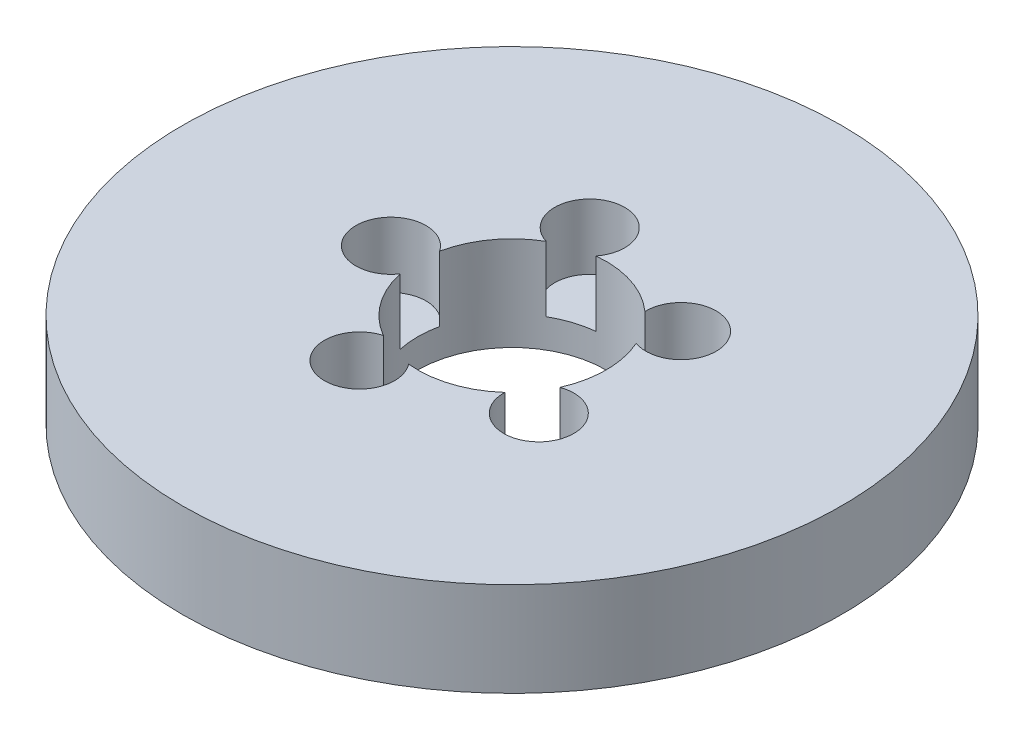
ISO-10303-21;
HEADER;
FILE_DESCRIPTION(('STEP AP214'),'2;1');
FILE_NAME('part.step','',(''),(''),'','','');
FILE_SCHEMA(('AUTOMOTIVE_DESIGN { 1 0 10303 214 1 1 1 1 }'));
ENDSEC;
DATA;
#1=APPLICATION_CONTEXT('core data for automotive mechanical design processes');
#2=APPLICATION_PROTOCOL_DEFINITION('international standard','automotive_design',2000,#1);
#3=PRODUCT_CONTEXT('',#1,'mechanical');
#4=PRODUCT('Part','Part','',(#3));
#5=PRODUCT_RELATED_PRODUCT_CATEGORY('part','',(#4));
#6=PRODUCT_DEFINITION_FORMATION('','',#4);
#7=PRODUCT_DEFINITION_CONTEXT('part definition',#1,'design');
#8=PRODUCT_DEFINITION('design','',#6,#7);
#9=PRODUCT_DEFINITION_SHAPE('','',#8);
#10=(LENGTH_UNIT() NAMED_UNIT(*) SI_UNIT(.MILLI.,.METRE.));
#11=(NAMED_UNIT(*) PLANE_ANGLE_UNIT() SI_UNIT($,.RADIAN.));
#12=(NAMED_UNIT(*) SI_UNIT($,.STERADIAN.) SOLID_ANGLE_UNIT());
#13=UNCERTAINTY_MEASURE_WITH_UNIT(LENGTH_MEASURE(1.E-05),#10,'distance_accuracy_value','');
#14=(GEOMETRIC_REPRESENTATION_CONTEXT(3) GLOBAL_UNCERTAINTY_ASSIGNED_CONTEXT((#13)) GLOBAL_UNIT_ASSIGNED_CONTEXT((#10,
#11,#12)) REPRESENTATION_CONTEXT('',''));
#15=CARTESIAN_POINT('',(0.,0.,0.));
#16=DIRECTION('',(0.,0.,1.));
#17=DIRECTION('',(1.,0.,0.));
#18=AXIS2_PLACEMENT_3D('',#15,#16,#17);
#19=CARTESIAN_POINT('',(0.,10.,0.));
#20=DIRECTION('',(0.,-1.,0.));
#21=DIRECTION('',(0.,0.,-1.));
#22=AXIS2_PLACEMENT_3D('',#19,#20,#21);
#23=CYLINDRICAL_SURFACE('',#22,35.);
#24=CARTESIAN_POINT('',(0.,10.,0.));
#25=DIRECTION('',(0.,1.,0.));
#26=DIRECTION('',(0.,0.,1.));
#27=AXIS2_PLACEMENT_3D('',#24,#25,#26);
#28=CIRCLE('',#27,35.);
#29=CARTESIAN_POINT('',(0.,10.,35.));
#30=VERTEX_POINT('',#29);
#31=EDGE_CURVE('E157',#30,#30,#28,.T.);
#32=ORIENTED_EDGE('',*,*,#31,.F.);
#33=EDGE_LOOP('',(#32));
#34=FACE_BOUND('',#33,.T.);
#35=CARTESIAN_POINT('',(0.,0.,0.));
#36=DIRECTION('',(0.,1.,0.));
#37=DIRECTION('',(0.,0.,1.));
#38=AXIS2_PLACEMENT_3D('',#35,#36,#37);
#39=CIRCLE('',#38,35.);
#40=CARTESIAN_POINT('',(0.,0.,35.));
#41=VERTEX_POINT('',#40);
#42=EDGE_CURVE('E150',#41,#41,#39,.T.);
#43=ORIENTED_EDGE('',*,*,#42,.T.);
#44=EDGE_LOOP('',(#43));
#45=FACE_BOUND('',#44,.T.);
#46=ADVANCED_FACE('F39',(#34,#45),#23,.T.);
#47=CARTESIAN_POINT('',(0.,10.,0.));
#48=DIRECTION('',(0.,1.,0.));
#49=DIRECTION('',(0.,0.,1.));
#50=AXIS2_PLACEMENT_3D('',#47,#48,#49);
#51=PLANE('',#50);
#52=CARTESIAN_POINT('',(-3.97246074891864,10.,-12.2259770490213));
#53=DIRECTION('',(0.,1.,0.));
#54=DIRECTION('',(-0.95105651629515,0.,0.309016994374958));
#55=AXIS2_PLACEMENT_3D('',#52,#53,#54);
#56=CIRCLE('',#55,3.72304344095065);
#57=CARTESIAN_POINT('',(-1.02845036730045,10.,-9.94697390375583));
#58=VERTEX_POINT('',#57);
#59=CARTESIAN_POINT('',(-5.01465074054874,10.,-8.65177888935645));
#60=VERTEX_POINT('',#59);
#61=EDGE_CURVE('E194',#58,#60,#56,.T.);
#62=ORIENTED_EDGE('',*,*,#61,.F.);
#63=CARTESIAN_POINT('',(0.,10.,0.));
#64=DIRECTION('',(0.,1.,0.));
#65=DIRECTION('',(0.,0.,1.));
#66=AXIS2_PLACEMENT_3D('',#63,#64,#65);
#67=CIRCLE('',#66,10.);
#68=CARTESIAN_POINT('',(6.67871839058284,10.,-7.44276297212874));
#69=VERTEX_POINT('',#68);
#70=EDGE_CURVE('E147',#69,#58,#67,.T.);
#71=ORIENTED_EDGE('',*,*,#70,.F.);
#72=CARTESIAN_POINT('',(10.4000372596434,10.,-7.55606936197143));
#73=DIRECTION('',(0.,1.,0.));
#74=DIRECTION('',(-0.58778525229248,0.,-0.809016994374942));
#75=AXIS2_PLACEMENT_3D('',#72,#73,#74);
#76=CIRCLE('',#75,3.72304344095065);
#77=CARTESIAN_POINT('',(9.14232570721784,10.,-4.05189840237188));
#78=VERTEX_POINT('',#77);
#79=EDGE_CURVE('E254',#78,#69,#76,.T.);
#80=ORIENTED_EDGE('',*,*,#79,.F.);
#81=CARTESIAN_POINT('',(9.1423257072179,10.,4.05189840237175));
#82=VERTEX_POINT('',#81);
#83=EDGE_CURVE('E144',#82,#78,#67,.T.);
#84=ORIENTED_EDGE('',*,*,#83,.F.);
#85=CARTESIAN_POINT('',(10.4000372596435,10.,7.55606936197128));
#86=DIRECTION('',(0.,1.,0.));
#87=DIRECTION('',(0.587785252292469,0.,-0.809016994374951));
#88=AXIS2_PLACEMENT_3D('',#85,#86,#87);
#89=CIRCLE('',#88,3.72304344095065);
#90=CARTESIAN_POINT('',(6.67871839058295,10.,7.44276297212864));
#91=VERTEX_POINT('',#90);
#92=EDGE_CURVE('E141',#91,#82,#89,.T.);
#93=ORIENTED_EDGE('',*,*,#92,.F.);
#94=CARTESIAN_POINT('',(-1.02845036730031,10.,9.94697390375585));
#95=VERTEX_POINT('',#94);
#96=EDGE_CURVE('E134',#95,#91,#67,.T.);
#97=ORIENTED_EDGE('',*,*,#96,.F.);
#98=CARTESIAN_POINT('',(-3.97246074891847,10.,12.2259770490214));
#99=DIRECTION('',(0.,1.,0.));
#100=DIRECTION('',(0.951056516295155,0.,0.309016994374945));
#101=AXIS2_PLACEMENT_3D('',#98,#99,#100);
#102=CIRCLE('',#101,3.72304344095065);
#103=CARTESIAN_POINT('',(-5.01465074054862,10.,8.65177888935652));
#104=VERTEX_POINT('',#103);
#105=EDGE_CURVE('E111',#104,#95,#102,.T.);
#106=ORIENTED_EDGE('',*,*,#105,.F.);
#107=CARTESIAN_POINT('',(-9.7779429899518,10.,2.09566955535754));
#108=VERTEX_POINT('',#107);
#109=EDGE_CURVE('E145',#108,#104,#67,.T.);
#110=ORIENTED_EDGE('',*,*,#109,.F.);
#111=CARTESIAN_POINT('',(-12.85515302145,10.,0.));
#112=DIRECTION('',(0.,1.,0.));
#113=DIRECTION('',(0.,0.,1.));
#114=AXIS2_PLACEMENT_3D('',#111,#112,#113);
#115=CIRCLE('',#114,3.72304344095065);
#116=CARTESIAN_POINT('',(-9.7779429899518,10.,-2.09566955535754));
#117=VERTEX_POINT('',#116);
#118=EDGE_CURVE('E153',#117,#108,#115,.T.);
#119=ORIENTED_EDGE('',*,*,#118,.F.);
#120=EDGE_CURVE('E146',#60,#117,#67,.T.);
#121=ORIENTED_EDGE('',*,*,#120,.F.);
#122=EDGE_LOOP('',(#62,#71,#80,#84,#93,#97,#106,#110,#119,#121));
#123=FACE_BOUND('',#122,.T.);
#124=ORIENTED_EDGE('',*,*,#31,.T.);
#125=EDGE_LOOP('',(#124));
#126=FACE_BOUND('',#125,.T.);
#127=ADVANCED_FACE('F139',(#123,#126),#51,.T.);
#128=CARTESIAN_POINT('',(0.,0.,0.));
#129=DIRECTION('',(0.,1.,0.));
#130=DIRECTION('',(0.,0.,1.));
#131=AXIS2_PLACEMENT_3D('',#128,#129,#130);
#132=PLANE('',#131);
#133=CARTESIAN_POINT('',(0.,0.,0.));
#134=DIRECTION('',(0.,1.,0.));
#135=DIRECTION('',(0.,0.,1.));
#136=AXIS2_PLACEMENT_3D('',#133,#134,#135);
#137=CIRCLE('',#136,10.);
#138=CARTESIAN_POINT('',(0.,0.,10.));
#139=VERTEX_POINT('',#138);
#140=EDGE_CURVE('E154',#139,#139,#137,.T.);
#141=ORIENTED_EDGE('',*,*,#140,.T.);
#142=EDGE_LOOP('',(#141));
#143=FACE_BOUND('',#142,.T.);
#144=ORIENTED_EDGE('',*,*,#42,.F.);
#145=EDGE_LOOP('',(#144));
#146=FACE_BOUND('',#145,.T.);
#147=ADVANCED_FACE('F213',(#143,#146),#132,.F.);
#148=CARTESIAN_POINT('',(0.,10.,0.));
#149=DIRECTION('',(0.,-1.,0.));
#150=DIRECTION('',(0.,0.,-1.));
#151=AXIS2_PLACEMENT_3D('',#148,#149,#150);
#152=CYLINDRICAL_SURFACE('',#151,10.);
#153=DIRECTION('',(0.,1.,0.));
#154=VECTOR('',#153,1.);
#155=CARTESIAN_POINT('',(-1.02845036730045,6.53355313447138,-9.94697390375584));
#156=LINE('',#155,#154);
#157=CARTESIAN_POINT('',(-1.02845036730045,3.06710626894277,-9.94697390375583));
#158=VERTEX_POINT('',#157);
#159=EDGE_CURVE('E11',#158,#58,#156,.T.);
#160=ORIENTED_EDGE('',*,*,#159,.F.);
#161=CARTESIAN_POINT('',(0.,3.06710626894277,0.));
#162=DIRECTION('',(0.,1.,0.));
#163=DIRECTION('',(0.,0.,1.));
#164=AXIS2_PLACEMENT_3D('',#161,#162,#163);
#165=CIRCLE('',#164,10.);
#166=CARTESIAN_POINT('',(-5.01465074054874,3.06710626894277,-8.65177888935645));
#167=VERTEX_POINT('',#166);
#168=EDGE_CURVE('E189',#158,#167,#165,.T.);
#169=ORIENTED_EDGE('',*,*,#168,.T.);
#170=DIRECTION('',(0.,1.,0.));
#171=VECTOR('',#170,1.);
#172=CARTESIAN_POINT('',(-5.01465074054875,6.53355313447138,-8.65177888935645));
#173=LINE('',#172,#171);
#174=EDGE_CURVE('E46',#60,#167,#173,.F.);
#175=ORIENTED_EDGE('',*,*,#174,.F.);
#176=ORIENTED_EDGE('',*,*,#120,.T.);
#177=DIRECTION('',(0.,1.,0.));
#178=VECTOR('',#177,1.);
#179=CARTESIAN_POINT('',(-9.7779429899518,6.53355313447138,-2.09566955535754));
#180=LINE('',#179,#178);
#181=CARTESIAN_POINT('',(-9.7779429899518,3.06710626894277,-2.09566955535754));
#182=VERTEX_POINT('',#181);
#183=EDGE_CURVE('E168',#182,#117,#180,.T.);
#184=ORIENTED_EDGE('',*,*,#183,.F.);
#185=CARTESIAN_POINT('',(0.,3.06710626894277,0.));
#186=DIRECTION('',(0.,1.,0.));
#187=DIRECTION('',(0.,0.,1.));
#188=AXIS2_PLACEMENT_3D('',#185,#186,#187);
#189=CIRCLE('',#188,10.);
#190=CARTESIAN_POINT('',(-9.7779429899518,3.06710626894277,2.09566955535754));
#191=VERTEX_POINT('',#190);
#192=EDGE_CURVE('E165',#182,#191,#189,.T.);
#193=ORIENTED_EDGE('',*,*,#192,.T.);
#194=DIRECTION('',(0.,1.,0.));
#195=VECTOR('',#194,1.);
#196=CARTESIAN_POINT('',(-9.7779429899518,6.53355313447138,2.09566955535754));
#197=LINE('',#196,#195);
#198=EDGE_CURVE('E170',#108,#191,#197,.F.);
#199=ORIENTED_EDGE('',*,*,#198,.F.);
#200=ORIENTED_EDGE('',*,*,#109,.T.);
#201=DIRECTION('',(0.,1.,0.));
#202=VECTOR('',#201,1.);
#203=CARTESIAN_POINT('',(-5.01465074054862,6.53355313447138,8.65177888935652));
#204=LINE('',#203,#202);
#205=CARTESIAN_POINT('',(-5.01465074054862,3.06710626894277,8.65177888935652));
#206=VERTEX_POINT('',#205);
#207=EDGE_CURVE('E121',#206,#104,#204,.T.);
#208=ORIENTED_EDGE('',*,*,#207,.F.);
#209=CARTESIAN_POINT('',(0.,3.06710626894277,0.));
#210=DIRECTION('',(0.,1.,0.));
#211=DIRECTION('',(0.,0.,1.));
#212=AXIS2_PLACEMENT_3D('',#209,#210,#211);
#213=CIRCLE('',#212,10.);
#214=CARTESIAN_POINT('',(-1.02845036730031,3.06710626894277,9.94697390375585));
#215=VERTEX_POINT('',#214);
#216=EDGE_CURVE('E136',#206,#215,#213,.T.);
#217=ORIENTED_EDGE('',*,*,#216,.T.);
#218=DIRECTION('',(0.,1.,0.));
#219=VECTOR('',#218,1.);
#220=CARTESIAN_POINT('',(-1.02845036730031,6.53355313447138,9.94697390375585));
#221=LINE('',#220,#219);
#222=EDGE_CURVE('E117',#95,#215,#221,.F.);
#223=ORIENTED_EDGE('',*,*,#222,.F.);
#224=ORIENTED_EDGE('',*,*,#96,.T.);
#225=DIRECTION('',(0.,1.,0.));
#226=VECTOR('',#225,1.);
#227=CARTESIAN_POINT('',(6.67871839058295,6.53355313447138,7.44276297212864));
#228=LINE('',#227,#226);
#229=CARTESIAN_POINT('',(6.67871839058295,3.06710626894277,7.44276297212864));
#230=VERTEX_POINT('',#229);
#231=EDGE_CURVE('E182',#230,#91,#228,.T.);
#232=ORIENTED_EDGE('',*,*,#231,.F.);
#233=CARTESIAN_POINT('',(0.,3.06710626894277,0.));
#234=DIRECTION('',(0.,1.,0.));
#235=DIRECTION('',(0.,0.,1.));
#236=AXIS2_PLACEMENT_3D('',#233,#234,#235);
#237=CIRCLE('',#236,10.);
#238=CARTESIAN_POINT('',(9.1423257072179,3.06710626894277,4.05189840237175));
#239=VERTEX_POINT('',#238);
#240=EDGE_CURVE('E174',#230,#239,#237,.T.);
#241=ORIENTED_EDGE('',*,*,#240,.T.);
#242=DIRECTION('',(0.,1.,0.));
#243=VECTOR('',#242,1.);
#244=CARTESIAN_POINT('',(9.1423257072179,6.53355313447138,4.05189840237175));
#245=LINE('',#244,#243);
#246=EDGE_CURVE('E177',#82,#239,#245,.F.);
#247=ORIENTED_EDGE('',*,*,#246,.F.);
#248=ORIENTED_EDGE('',*,*,#83,.T.);
#249=DIRECTION('',(0.,1.,0.));
#250=VECTOR('',#249,1.);
#251=CARTESIAN_POINT('',(9.14232570721785,6.53355313447138,-4.05189840237188));
#252=LINE('',#251,#250);
#253=CARTESIAN_POINT('',(9.14232570721784,3.06710626894277,-4.05189840237188));
#254=VERTEX_POINT('',#253);
#255=EDGE_CURVE('E187',#254,#78,#252,.T.);
#256=ORIENTED_EDGE('',*,*,#255,.F.);
#257=CARTESIAN_POINT('',(0.,3.06710626894277,0.));
#258=DIRECTION('',(0.,1.,0.));
#259=DIRECTION('',(0.,0.,1.));
#260=AXIS2_PLACEMENT_3D('',#257,#258,#259);
#261=CIRCLE('',#260,10.);
#262=CARTESIAN_POINT('',(6.67871839058284,3.06710626894277,-7.44276297212874));
#263=VERTEX_POINT('',#262);
#264=EDGE_CURVE('E181',#254,#263,#261,.T.);
#265=ORIENTED_EDGE('',*,*,#264,.T.);
#266=DIRECTION('',(0.,1.,0.));
#267=VECTOR('',#266,1.);
#268=CARTESIAN_POINT('',(6.67871839058284,6.53355313447138,-7.44276297212874));
#269=LINE('',#268,#267);
#270=EDGE_CURVE('E186',#69,#263,#269,.F.);
#271=ORIENTED_EDGE('',*,*,#270,.F.);
#272=ORIENTED_EDGE('',*,*,#70,.T.);
#273=EDGE_LOOP('',(#160,#169,#175,#176,#184,#193,#199,#200,#208,#217,#223,#224,#232,#241,#247,
#248,#256,#265,#271,#272));
#274=FACE_BOUND('',#273,.T.);
#275=ORIENTED_EDGE('',*,*,#140,.F.);
#276=EDGE_LOOP('',(#275));
#277=FACE_BOUND('',#276,.T.);
#278=ADVANCED_FACE('F135',(#274,#277),#152,.F.);
#279=CARTESIAN_POINT('',(-12.85515302145,3.06710626894277,0.));
#280=DIRECTION('',(0.,1.,0.));
#281=DIRECTION('',(0.,0.,1.));
#282=AXIS2_PLACEMENT_3D('',#279,#280,#281);
#283=CYLINDRICAL_SURFACE('',#282,3.72304344095065);
#284=ORIENTED_EDGE('',*,*,#183,.T.);
#285=ORIENTED_EDGE('',*,*,#118,.T.);
#286=ORIENTED_EDGE('',*,*,#198,.T.);
#287=CARTESIAN_POINT('',(-12.85515302145,3.06710626894277,0.));
#288=DIRECTION('',(0.,1.,0.));
#289=DIRECTION('',(0.,0.,1.));
#290=AXIS2_PLACEMENT_3D('',#287,#288,#289);
#291=CIRCLE('',#290,3.72304344095065);
#292=EDGE_CURVE('E158',#182,#191,#291,.T.);
#293=ORIENTED_EDGE('',*,*,#292,.F.);
#294=EDGE_LOOP('',(#284,#285,#286,#293));
#295=FACE_BOUND('',#294,.T.);
#296=ADVANCED_FACE('F221',(#295),#283,.F.);
#297=CARTESIAN_POINT('',(-12.85515302145,3.06710626894277,0.));
#298=DIRECTION('',(0.,1.,0.));
#299=DIRECTION('',(0.,0.,1.));
#300=AXIS2_PLACEMENT_3D('',#297,#298,#299);
#301=PLANE('',#300);
#302=ORIENTED_EDGE('',*,*,#292,.T.);
#303=ORIENTED_EDGE('',*,*,#192,.F.);
#304=EDGE_LOOP('',(#302,#303));
#305=FACE_BOUND('',#304,.T.);
#306=ADVANCED_FACE('F227',(#305),#301,.T.);
#307=CARTESIAN_POINT('',(-3.97246074891847,3.06710626894277,12.2259770490214));
#308=DIRECTION('',(0.,1.,0.));
#309=DIRECTION('',(0.,0.,1.));
#310=AXIS2_PLACEMENT_3D('',#307,#308,#309);
#311=CYLINDRICAL_SURFACE('',#310,3.72304344095065);
#312=ORIENTED_EDGE('',*,*,#207,.T.);
#313=ORIENTED_EDGE('',*,*,#105,.T.);
#314=ORIENTED_EDGE('',*,*,#222,.T.);
#315=CARTESIAN_POINT('',(-3.97246074891847,3.06710626894277,12.2259770490214));
#316=DIRECTION('',(0.,1.,0.));
#317=DIRECTION('',(0.951056516295155,0.,0.309016994374945));
#318=AXIS2_PLACEMENT_3D('',#315,#316,#317);
#319=CIRCLE('',#318,3.72304344095065);
#320=EDGE_CURVE('E127',#206,#215,#319,.T.);
#321=ORIENTED_EDGE('',*,*,#320,.F.);
#322=EDGE_LOOP('',(#312,#313,#314,#321));
#323=FACE_BOUND('',#322,.T.);
#324=ADVANCED_FACE('F116',(#323),#311,.F.);
#325=CARTESIAN_POINT('',(-3.97246074891847,3.06710626894277,12.2259770490214));
#326=DIRECTION('',(0.,1.,0.));
#327=DIRECTION('',(0.951056516295155,0.,0.309016994374945));
#328=AXIS2_PLACEMENT_3D('',#325,#326,#327);
#329=PLANE('',#328);
#330=ORIENTED_EDGE('',*,*,#320,.T.);
#331=ORIENTED_EDGE('',*,*,#216,.F.);
#332=EDGE_LOOP('',(#330,#331));
#333=FACE_BOUND('',#332,.T.);
#334=ADVANCED_FACE('F234',(#333),#329,.T.);
#335=CARTESIAN_POINT('',(10.4000372596435,3.06710626894277,7.55606936197128));
#336=DIRECTION('',(0.,1.,0.));
#337=DIRECTION('',(0.,0.,1.));
#338=AXIS2_PLACEMENT_3D('',#335,#336,#337);
#339=CYLINDRICAL_SURFACE('',#338,3.72304344095065);
#340=ORIENTED_EDGE('',*,*,#231,.T.);
#341=ORIENTED_EDGE('',*,*,#92,.T.);
#342=ORIENTED_EDGE('',*,*,#246,.T.);
#343=CARTESIAN_POINT('',(10.4000372596435,3.06710626894277,7.55606936197128));
#344=DIRECTION('',(0.,1.,0.));
#345=DIRECTION('',(0.587785252292469,0.,-0.809016994374951));
#346=AXIS2_PLACEMENT_3D('',#343,#344,#345);
#347=CIRCLE('',#346,3.72304344095065);
#348=EDGE_CURVE('E130',#230,#239,#347,.T.);
#349=ORIENTED_EDGE('',*,*,#348,.F.);
#350=EDGE_LOOP('',(#340,#341,#342,#349));
#351=FACE_BOUND('',#350,.T.);
#352=ADVANCED_FACE('F240',(#351),#339,.F.);
#353=CARTESIAN_POINT('',(10.4000372596435,3.06710626894277,7.55606936197128));
#354=DIRECTION('',(0.,1.,0.));
#355=DIRECTION('',(0.587785252292469,0.,-0.809016994374951));
#356=AXIS2_PLACEMENT_3D('',#353,#354,#355);
#357=PLANE('',#356);
#358=ORIENTED_EDGE('',*,*,#348,.T.);
#359=ORIENTED_EDGE('',*,*,#240,.F.);
#360=EDGE_LOOP('',(#358,#359));
#361=FACE_BOUND('',#360,.T.);
#362=ADVANCED_FACE('F245',(#361),#357,.T.);
#363=CARTESIAN_POINT('',(10.4000372596434,3.06710626894277,-7.55606936197143));
#364=DIRECTION('',(0.,1.,0.));
#365=DIRECTION('',(0.,0.,1.));
#366=AXIS2_PLACEMENT_3D('',#363,#364,#365);
#367=CYLINDRICAL_SURFACE('',#366,3.72304344095065);
#368=ORIENTED_EDGE('',*,*,#255,.T.);
#369=ORIENTED_EDGE('',*,*,#79,.T.);
#370=ORIENTED_EDGE('',*,*,#270,.T.);
#371=CARTESIAN_POINT('',(10.4000372596434,3.06710626894277,-7.55606936197143));
#372=DIRECTION('',(0.,1.,0.));
#373=DIRECTION('',(-0.58778525229248,0.,-0.809016994374942));
#374=AXIS2_PLACEMENT_3D('',#371,#372,#373);
#375=CIRCLE('',#374,3.72304344095065);
#376=EDGE_CURVE('E56',#254,#263,#375,.T.);
#377=ORIENTED_EDGE('',*,*,#376,.F.);
#378=EDGE_LOOP('',(#368,#369,#370,#377));
#379=FACE_BOUND('',#378,.T.);
#380=ADVANCED_FACE('F266',(#379),#367,.F.);
#381=CARTESIAN_POINT('',(10.4000372596434,3.06710626894277,-7.55606936197143));
#382=DIRECTION('',(0.,1.,0.));
#383=DIRECTION('',(-0.58778525229248,0.,-0.809016994374942));
#384=AXIS2_PLACEMENT_3D('',#381,#382,#383);
#385=PLANE('',#384);
#386=ORIENTED_EDGE('',*,*,#376,.T.);
#387=ORIENTED_EDGE('',*,*,#264,.F.);
#388=EDGE_LOOP('',(#386,#387));
#389=FACE_BOUND('',#388,.T.);
#390=ADVANCED_FACE('F204',(#389),#385,.T.);
#391=CARTESIAN_POINT('',(-3.97246074891864,3.06710626894277,-12.2259770490213));
#392=DIRECTION('',(0.,1.,0.));
#393=DIRECTION('',(0.,0.,1.));
#394=AXIS2_PLACEMENT_3D('',#391,#392,#393);
#395=CYLINDRICAL_SURFACE('',#394,3.72304344095065);
#396=ORIENTED_EDGE('',*,*,#159,.T.);
#397=ORIENTED_EDGE('',*,*,#61,.T.);
#398=ORIENTED_EDGE('',*,*,#174,.T.);
#399=CARTESIAN_POINT('',(-3.97246074891864,3.06710626894277,-12.2259770490213));
#400=DIRECTION('',(0.,1.,0.));
#401=DIRECTION('',(-0.95105651629515,0.,0.309016994374958));
#402=AXIS2_PLACEMENT_3D('',#399,#400,#401);
#403=CIRCLE('',#402,3.72304344095065);
#404=EDGE_CURVE('E55',#158,#167,#403,.T.);
#405=ORIENTED_EDGE('',*,*,#404,.F.);
#406=EDGE_LOOP('',(#396,#397,#398,#405));
#407=FACE_BOUND('',#406,.T.);
#408=ADVANCED_FACE('F193',(#407),#395,.F.);
#409=CARTESIAN_POINT('',(-3.97246074891864,3.06710626894277,-12.2259770490213));
#410=DIRECTION('',(0.,1.,0.));
#411=DIRECTION('',(-0.95105651629515,0.,0.309016994374958));
#412=AXIS2_PLACEMENT_3D('',#409,#410,#411);
#413=PLANE('',#412);
#414=ORIENTED_EDGE('',*,*,#404,.T.);
#415=ORIENTED_EDGE('',*,*,#168,.F.);
#416=EDGE_LOOP('',(#414,#415));
#417=FACE_BOUND('',#416,.T.);
#418=ADVANCED_FACE('F196',(#417),#413,.T.);
#419=CLOSED_SHELL('',(#46,#127,#147,#278,#296,#306,#324,#334,#352,#362,#380,#390,#408,#418));
#420=MANIFOLD_SOLID_BREP('B2',#419);
#421=ADVANCED_BREP_SHAPE_REPRESENTATION('',(#18,#420),#14);
#422=SHAPE_DEFINITION_REPRESENTATION(#9,#421);
ENDSEC;
END-ISO-10303-21;
